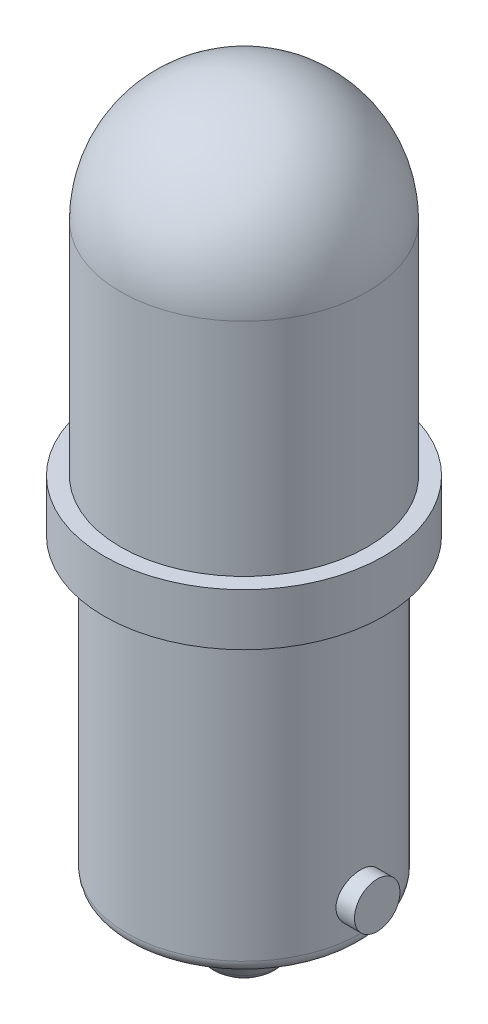
ISO-10303-21;
HEADER;
FILE_DESCRIPTION(('STEP AP214'),'2;1');
FILE_NAME('part.step','',(''),(''),'','','');
FILE_SCHEMA(('AUTOMOTIVE_DESIGN { 1 0 10303 214 1 1 1 1 }'));
ENDSEC;
DATA;
#1=APPLICATION_CONTEXT('core data for automotive mechanical design processes');
#2=APPLICATION_PROTOCOL_DEFINITION('international standard','automotive_design',2000,#1);
#3=PRODUCT_CONTEXT('',#1,'mechanical');
#4=PRODUCT('Part','Part','',(#3));
#5=PRODUCT_RELATED_PRODUCT_CATEGORY('part','',(#4));
#6=PRODUCT_DEFINITION_FORMATION('','',#4);
#7=PRODUCT_DEFINITION_CONTEXT('part definition',#1,'design');
#8=PRODUCT_DEFINITION('design','',#6,#7);
#9=PRODUCT_DEFINITION_SHAPE('','',#8);
#10=(LENGTH_UNIT() NAMED_UNIT(*) SI_UNIT(.MILLI.,.METRE.));
#11=(NAMED_UNIT(*) PLANE_ANGLE_UNIT() SI_UNIT($,.RADIAN.));
#12=(NAMED_UNIT(*) SI_UNIT($,.STERADIAN.) SOLID_ANGLE_UNIT());
#13=UNCERTAINTY_MEASURE_WITH_UNIT(LENGTH_MEASURE(1.E-05),#10,'distance_accuracy_value','');
#14=(GEOMETRIC_REPRESENTATION_CONTEXT(3) GLOBAL_UNCERTAINTY_ASSIGNED_CONTEXT((#13)) GLOBAL_UNIT_ASSIGNED_CONTEXT((#10,
#11,#12)) REPRESENTATION_CONTEXT('',''));
#15=CARTESIAN_POINT('',(0.,0.,0.));
#16=DIRECTION('',(0.,0.,1.));
#17=DIRECTION('',(1.,0.,0.));
#18=AXIS2_PLACEMENT_3D('',#15,#16,#17);
#19=CARTESIAN_POINT('',(0.,-11.684,0.));
#20=DIRECTION('',(0.,1.,0.));
#21=DIRECTION('',(0.,0.,1.));
#22=AXIS2_PLACEMENT_3D('',#19,#20,#21);
#23=CYLINDRICAL_SURFACE('',#22,4.572);
#24=CARTESIAN_POINT('',(-4.48473667008443,-9.906,0.889));
#25=CARTESIAN_POINT('',(-4.484737642636,-9.85657359150601,0.888998140814005));
#26=CARTESIAN_POINT('',(-4.48556264448461,-9.80712345159846,0.884864010478837));
#27=CARTESIAN_POINT('',(-4.48876899778666,-9.70962003210988,0.868449308597514));
#28=CARTESIAN_POINT('',(-4.49115162838292,-9.66156793452277,0.856162041476267));
#29=CARTESIAN_POINT('',(-4.49719342142709,-9.56828540528058,0.823834764819868));
#30=CARTESIAN_POINT('',(-4.50085135033537,-9.52305229659918,0.803802244891879));
#31=CARTESIAN_POINT('',(-4.50903011912911,-9.43659091599146,0.756573321078222));
#32=CARTESIAN_POINT('',(-4.51355090221067,-9.39536238070328,0.729377388733529));
#33=CARTESIAN_POINT('',(-4.52301354107814,-9.31752652000002,0.668205930866874));
#34=CARTESIAN_POINT('',(-4.52795979613049,-9.28098053911341,0.63415301765999));
#35=CARTESIAN_POINT('',(-4.53767728003765,-9.21408225812862,0.560401461641953));
#36=CARTESIAN_POINT('',(-4.54244849696182,-9.18373037958115,0.520702434886226));
#37=CARTESIAN_POINT('',(-4.55132562195848,-9.1298451771,0.436380815476984));
#38=CARTESIAN_POINT('',(-4.55542573977348,-9.10636994302105,0.391720439051687));
#39=CARTESIAN_POINT('',(-4.5624493549543,-9.06727898284693,0.29899640452131));
#40=CARTESIAN_POINT('',(-4.56537295637947,-9.05166256163265,0.250933047842027));
#41=CARTESIAN_POINT('',(-4.56968305148856,-9.02892291194159,0.153403610176242));
#42=CARTESIAN_POINT('',(-4.57108826352083,-9.0216961727316,0.103962504363145));
#43=CARTESIAN_POINT('',(-4.57226783937727,-9.01561827081581,0.00455097775357867));
#44=CARTESIAN_POINT('',(-4.57204235209319,-9.01676634344402,-0.0454193943019874));
#45=CARTESIAN_POINT('',(-4.57000049582018,-9.02732657031017,-0.143760338651606));
#46=CARTESIAN_POINT('',(-4.56820558784158,-9.03662724621937,-0.192143392135824));
#47=CARTESIAN_POINT('',(-4.56325070896854,-9.06305207698569,-0.286648733786454));
#48=CARTESIAN_POINT('',(-4.56009068561256,-9.08017653251293,-0.332770934992221));
#49=CARTESIAN_POINT('',(-4.55272504103654,-9.1218674245143,-0.421765763206312));
#50=CARTESIAN_POINT('',(-4.54851325438613,-9.14647793663826,-0.46461721121851));
#51=CARTESIAN_POINT('',(-4.53950905688584,-9.20240978841156,-0.545623587310608));
#52=CARTESIAN_POINT('',(-4.53471658274704,-9.23373185983752,-0.583778002547482));
#53=CARTESIAN_POINT('',(-4.52498782298533,-9.30281051926224,-0.654968341766946));
#54=CARTESIAN_POINT('',(-4.52005046897733,-9.34066465589187,-0.687909533441519));
#55=CARTESIAN_POINT('',(-4.51066361045973,-9.42140925955546,-0.74699088713683));
#56=CARTESIAN_POINT('',(-4.50621411419761,-9.46429981170717,-0.773130934191068));
#57=CARTESIAN_POINT('',(-4.49830490051665,-9.55403106185394,-0.817898080490989));
#58=CARTESIAN_POINT('',(-4.49484711364946,-9.60087923779006,-0.836510554367289));
#59=CARTESIAN_POINT('',(-4.48934168214752,-9.69712045737962,-0.865572782843082));
#60=CARTESIAN_POINT('',(-4.48729386465183,-9.74651318827466,-0.876023538082765));
#61=CARTESIAN_POINT('',(-4.48487467077598,-9.84558480881087,-0.888325567668125));
#62=CARTESIAN_POINT('',(-4.48447668988019,-9.89524611926337,-0.890313326758572));
#63=CARTESIAN_POINT('',(-4.4853309164198,-9.99419086404617,-0.885999571815607));
#64=CARTESIAN_POINT('',(-4.48658303571788,-10.0434743184176,-0.879698500516071));
#65=CARTESIAN_POINT('',(-4.49057152584208,-10.1398101681926,-0.859103391229102));
#66=CARTESIAN_POINT('',(-4.49329446371905,-10.1868786273042,-0.844881656489838));
#67=CARTESIAN_POINT('',(-4.49990609866369,-10.2779646560244,-0.808925964574196));
#68=CARTESIAN_POINT('',(-4.50379488723393,-10.3219819858291,-0.787191417729216));
#69=CARTESIAN_POINT('',(-4.51236019289327,-10.4063153221001,-0.736515775284432));
#70=CARTESIAN_POINT('',(-4.51704585416258,-10.4465788422343,-0.707488908369603));
#71=CARTESIAN_POINT('',(-4.52665157592584,-10.5217131652479,-0.64316752222962));
#72=CARTESIAN_POINT('',(-4.53157165912782,-10.5565834442986,-0.607872394902273));
#73=CARTESIAN_POINT('',(-4.54117781589628,-10.6204554977142,-0.531405089042378));
#74=CARTESIAN_POINT('',(-4.54585948175815,-10.6493652105655,-0.490155370520767));
#75=CARTESIAN_POINT('',(-4.55438579424391,-10.6998439757488,-0.403305270772477));
#76=CARTESIAN_POINT('',(-4.55823047473837,-10.7214133251456,-0.357705065705855));
#77=CARTESIAN_POINT('',(-4.56463074343345,-10.7564632598052,-0.263695999789592));
#78=CARTESIAN_POINT('',(-4.56719335690078,-10.7699880054964,-0.215304102942085));
#79=CARTESIAN_POINT('',(-4.57077081345575,-10.7887052068961,-0.116880818338055));
#80=CARTESIAN_POINT('',(-4.57178583227639,-10.7938986086519,-0.0668496173875124));
#81=CARTESIAN_POINT('',(-4.57214987781822,-10.795770731601,0.032551147359359));
#82=CARTESIAN_POINT('',(-4.57152604199332,-10.7925881474203,0.081918052568314));
#83=CARTESIAN_POINT('',(-4.56873922886259,-10.7781037589498,0.179399337726012));
#84=CARTESIAN_POINT('',(-4.56657626877663,-10.7668020454977,0.227513731681729));
#85=CARTESIAN_POINT('',(-4.56095465402552,-10.7364604280118,0.321043698461544));
#86=CARTESIAN_POINT('',(-4.55749864749902,-10.7174363325758,0.366464568821173));
#87=CARTESIAN_POINT('',(-4.54966396021267,-10.6722070879365,0.453489843197415));
#88=CARTESIAN_POINT('',(-4.54528521148891,-10.6460014097361,0.49509396577009));
#89=CARTESIAN_POINT('',(-4.53600266776793,-10.5866807066539,0.573992974912792));
#90=CARTESIAN_POINT('',(-4.53109185867807,-10.5534660110073,0.611212106731852));
#91=CARTESIAN_POINT('',(-4.52134149617608,-10.4812758434643,0.679596305625663));
#92=CARTESIAN_POINT('',(-4.51650195985403,-10.4422990138576,0.710759941850027));
#93=CARTESIAN_POINT('',(-4.50738858157874,-10.3592203822593,0.766445400699442));
#94=CARTESIAN_POINT('',(-4.50312093083298,-10.315070898635,0.790897137228966));
#95=CARTESIAN_POINT('',(-4.49570961523559,-10.2232204974382,0.831996825679656));
#96=CARTESIAN_POINT('',(-4.49256491264708,-10.1755229082561,0.848651987007617));
#97=CARTESIAN_POINT('',(-4.48839597216564,-10.0907518761683,0.870385702989092));
#98=CARTESIAN_POINT('',(-4.48703207687263,-10.0541678638263,0.877353814277506));
#99=CARTESIAN_POINT('',(-4.48520207374987,-9.98039370356091,0.886661590623503));
#100=CARTESIAN_POINT('',(-4.48473593803863,-9.94320357449763,0.889001399421215));
#101=CARTESIAN_POINT('',(-4.48473667008443,-9.906,0.889));
#102=B_SPLINE_CURVE_WITH_KNOTS('',3,(#24,#25,#26,#27,#28,#29,#30,#31,#32,#33,#34,#35,#36,#37,
#38,#39,#40,#41,#42,#43,#44,#45,#46,#47,#48,#49,#50,#51,#52,#53,#54,#55,#56,#57,#58,#59,#60,#61,
#62,#63,#64,#65,#66,#67,#68,#69,#70,#71,#72,#73,#74,#75,#76,#77,#78,#79,#80,#81,#82,#83,#84,#85,
#86,#87,#88,#89,#90,#91,#92,#93,#94,#95,#96,#97,#98,#99,#100,#101),.UNSPECIFIED.,.T.,.F.,(4,2,2,
2,2,2,2,2,2,2,2,2,2,2,2,2,2,2,2,2,2,2,2,2,2,2,2,2,2,2,2,2,2,2,2,2,2,2,4),(0.,0.148143039013353,
0.296407887891953,0.444529722802273,0.592641809835036,0.742530003786011,0.892428395246965,
1.04355875704167,1.19467574886872,1.34390777125264,1.4931261681099,1.64033544148188,
1.78755037262498,1.93564941207766,2.08376460733058,2.23432114053152,2.38488021857372,
2.53573042953052,2.68656214309756,2.83495191933392,2.98333376990286,3.1303828167238,
3.27744340781087,3.42632208126376,3.57521520576778,3.72625941625855,3.87729751325542,
4.0274986538357,4.17768273745278,4.32539569030554,4.47310699055748,4.62051742170219,
4.76793871405207,4.91761777898949,5.06733216863368,5.21855506542092,5.36963785049518,
5.48114952880724,5.59265774387224),.UNSPECIFIED.);
#103=CARTESIAN_POINT('',(-4.48473667008443,-9.906,0.889));
#104=VERTEX_POINT('',#103);
#105=EDGE_CURVE('E44',#104,#104,#102,.T.);
#106=ORIENTED_EDGE('',*,*,#105,.F.);
#107=EDGE_LOOP('',(#106));
#108=FACE_BOUND('',#107,.T.);
#109=CARTESIAN_POINT('',(0.,-11.176,0.));
#110=DIRECTION('',(0.,-1.,0.));
#111=DIRECTION('',(0.,0.,-1.));
#112=AXIS2_PLACEMENT_3D('',#109,#110,#111);
#113=CIRCLE('',#112,4.572);
#114=CARTESIAN_POINT('',(0.,-11.176,-4.572));
#115=VERTEX_POINT('',#114);
#116=EDGE_CURVE('E48',#115,#115,#113,.F.);
#117=ORIENTED_EDGE('',*,*,#116,.T.);
#118=EDGE_LOOP('',(#117));
#119=FACE_BOUND('',#118,.T.);
#120=CARTESIAN_POINT('',(0.,0.,0.));
#121=DIRECTION('',(0.,1.,0.));
#122=DIRECTION('',(0.,0.,1.));
#123=AXIS2_PLACEMENT_3D('',#120,#121,#122);
#124=CIRCLE('',#123,4.572);
#125=CARTESIAN_POINT('',(0.,0.,4.572));
#126=VERTEX_POINT('',#125);
#127=EDGE_CURVE('E118',#126,#126,#124,.F.);
#128=ORIENTED_EDGE('',*,*,#127,.T.);
#129=EDGE_LOOP('',(#128));
#130=FACE_BOUND('',#129,.T.);
#131=CARTESIAN_POINT('',(4.48473667008443,-9.906,0.889));
#132=CARTESIAN_POINT('',(4.484737642636,-9.95542640849399,0.888998140814005));
#133=CARTESIAN_POINT('',(4.48556264448461,-10.0048765484015,0.884864010478837));
#134=CARTESIAN_POINT('',(4.48876899778666,-10.1023799678901,0.868449308597514));
#135=CARTESIAN_POINT('',(4.49115162838292,-10.1504320654772,0.856162041476267));
#136=CARTESIAN_POINT('',(4.49719342142709,-10.2437145947194,0.823834764819868));
#137=CARTESIAN_POINT('',(4.50085135033537,-10.2889477034008,0.803802244891879));
#138=CARTESIAN_POINT('',(4.50903011912911,-10.3754090840085,0.756573321078222));
#139=CARTESIAN_POINT('',(4.51355090221067,-10.4166376192967,0.729377388733529));
#140=CARTESIAN_POINT('',(4.52301354107814,-10.49447348,0.668205930866874));
#141=CARTESIAN_POINT('',(4.52795979613049,-10.5310194608866,0.63415301765999));
#142=CARTESIAN_POINT('',(4.53767728003765,-10.5979177418714,0.560401461641953));
#143=CARTESIAN_POINT('',(4.54244849696182,-10.6282696204189,0.520702434886226));
#144=CARTESIAN_POINT('',(4.55132562195848,-10.6821548229,0.436380815476984));
#145=CARTESIAN_POINT('',(4.55542573977348,-10.705630056979,0.391720439051687));
#146=CARTESIAN_POINT('',(4.5624493549543,-10.7447210171531,0.29899640452131));
#147=CARTESIAN_POINT('',(4.56537295637947,-10.7603374383674,0.250933047842027));
#148=CARTESIAN_POINT('',(4.56968305148856,-10.7830770880584,0.153403610176242));
#149=CARTESIAN_POINT('',(4.57108826352083,-10.7903038272684,0.103962504363145));
#150=CARTESIAN_POINT('',(4.57226783937727,-10.7963817291842,0.00455097775357867));
#151=CARTESIAN_POINT('',(4.57204235209319,-10.795233656556,-0.0454193943019874));
#152=CARTESIAN_POINT('',(4.57000049582018,-10.7846734296898,-0.143760338651606));
#153=CARTESIAN_POINT('',(4.56820558784158,-10.7753727537806,-0.192143392135824));
#154=CARTESIAN_POINT('',(4.56325070896854,-10.7489479230143,-0.286648733786454));
#155=CARTESIAN_POINT('',(4.56009068561256,-10.7318234674871,-0.332770934992221));
#156=CARTESIAN_POINT('',(4.55272504103654,-10.6901325754857,-0.421765763206312));
#157=CARTESIAN_POINT('',(4.54851325438613,-10.6655220633617,-0.46461721121851));
#158=CARTESIAN_POINT('',(4.53950905688584,-10.6095902115884,-0.545623587310608));
#159=CARTESIAN_POINT('',(4.53471658274704,-10.5782681401625,-0.583778002547482));
#160=CARTESIAN_POINT('',(4.52498782298533,-10.5091894807378,-0.654968341766946));
#161=CARTESIAN_POINT('',(4.52005046897733,-10.4713353441081,-0.687909533441519));
#162=CARTESIAN_POINT('',(4.51066361045973,-10.3905907404445,-0.74699088713683));
#163=CARTESIAN_POINT('',(4.50621411419761,-10.3477001882928,-0.773130934191068));
#164=CARTESIAN_POINT('',(4.49830490051665,-10.2579689381461,-0.817898080490989));
#165=CARTESIAN_POINT('',(4.49484711364946,-10.2111207622099,-0.836510554367289));
#166=CARTESIAN_POINT('',(4.48934168214752,-10.1148795426204,-0.865572782843082));
#167=CARTESIAN_POINT('',(4.48729386465183,-10.0654868117253,-0.876023538082765));
#168=CARTESIAN_POINT('',(4.48487467077598,-9.96641519118913,-0.888325567668125));
#169=CARTESIAN_POINT('',(4.48447668988019,-9.91675388073663,-0.890313326758572));
#170=CARTESIAN_POINT('',(4.4853309164198,-9.81780913595383,-0.885999571815607));
#171=CARTESIAN_POINT('',(4.48658303571788,-9.76852568158241,-0.879698500516071));
#172=CARTESIAN_POINT('',(4.49057152584208,-9.67218983180742,-0.859103391229102));
#173=CARTESIAN_POINT('',(4.49329446371905,-9.62512137269583,-0.844881656489838));
#174=CARTESIAN_POINT('',(4.49990609866369,-9.53403534397561,-0.808925964574196));
#175=CARTESIAN_POINT('',(4.50379488723393,-9.49001801417092,-0.787191417729216));
#176=CARTESIAN_POINT('',(4.51236019289327,-9.40568467789989,-0.736515775284432));
#177=CARTESIAN_POINT('',(4.51704585416258,-9.3654211577657,-0.707488908369603));
#178=CARTESIAN_POINT('',(4.52665157592584,-9.29028683475211,-0.64316752222962));
#179=CARTESIAN_POINT('',(4.53157165912782,-9.25541655570135,-0.607872394902273));
#180=CARTESIAN_POINT('',(4.54117781589628,-9.19154450228584,-0.531405089042378));
#181=CARTESIAN_POINT('',(4.54585948175815,-9.16263478943446,-0.490155370520766));
#182=CARTESIAN_POINT('',(4.55438579424391,-9.11215602425116,-0.403305270772475));
#183=CARTESIAN_POINT('',(4.55823047473837,-9.09058667485437,-0.357705065705854));
#184=CARTESIAN_POINT('',(4.56463074343345,-9.05553674019479,-0.263695999789592));
#185=CARTESIAN_POINT('',(4.56719335690078,-9.04201199450364,-0.215304102942086));
#186=CARTESIAN_POINT('',(4.57077081345575,-9.02329479310389,-0.116880818338056));
#187=CARTESIAN_POINT('',(4.57178583227639,-9.01810139134811,-0.0668496173875125));
#188=CARTESIAN_POINT('',(4.57214987781822,-9.01622926839897,0.032551147359359));
#189=CARTESIAN_POINT('',(4.57152604199332,-9.01941185257974,0.081918052568314));
#190=CARTESIAN_POINT('',(4.56873922886259,-9.03389624105021,0.179399337726012));
#191=CARTESIAN_POINT('',(4.56657626877663,-9.04519795450233,0.227513731681729));
#192=CARTESIAN_POINT('',(4.56095465402552,-9.07553957198825,0.321043698461544));
#193=CARTESIAN_POINT('',(4.55749864749902,-9.0945636674242,0.366464568821173));
#194=CARTESIAN_POINT('',(4.54966396021267,-9.13979291206355,0.453489843197415));
#195=CARTESIAN_POINT('',(4.54528521148891,-9.16599859026393,0.49509396577009));
#196=CARTESIAN_POINT('',(4.53600266776793,-9.22531929334614,0.573992974912792));
#197=CARTESIAN_POINT('',(4.53109185867807,-9.25853398899273,0.611212106731852));
#198=CARTESIAN_POINT('',(4.52134149617608,-9.33072415653566,0.679596305625663));
#199=CARTESIAN_POINT('',(4.51650195985403,-9.36970098614244,0.710759941850027));
#200=CARTESIAN_POINT('',(4.50738858157874,-9.45277961774074,0.766445400699442));
#201=CARTESIAN_POINT('',(4.50312093083298,-9.496929101365,0.790897137228966));
#202=CARTESIAN_POINT('',(4.49570961523559,-9.5887795025618,0.831996825679656));
#203=CARTESIAN_POINT('',(4.49256491264708,-9.63647709174388,0.848651987007617));
#204=CARTESIAN_POINT('',(4.48839597216564,-9.72124812383174,0.870385702989092));
#205=CARTESIAN_POINT('',(4.48703207687263,-9.75783213617368,0.877353814277506));
#206=CARTESIAN_POINT('',(4.48520207374987,-9.83160629643909,0.886661590623503));
#207=CARTESIAN_POINT('',(4.48473593803863,-9.86879642550237,0.889001399421215));
#208=CARTESIAN_POINT('',(4.48473667008443,-9.906,0.889));
#209=B_SPLINE_CURVE_WITH_KNOTS('',3,(#131,#132,#133,#134,#135,#136,#137,#138,#139,#140,#141,
#142,#143,#144,#145,#146,#147,#148,#149,#150,#151,#152,#153,#154,#155,#156,#157,#158,#159,#160,
#161,#162,#163,#164,#165,#166,#167,#168,#169,#170,#171,#172,#173,#174,#175,#176,#177,#178,#179,
#180,#181,#182,#183,#184,#185,#186,#187,#188,#189,#190,#191,#192,#193,#194,#195,#196,#197,#198,
#199,#200,#201,#202,#203,#204,#205,#206,#207,#208),.UNSPECIFIED.,.T.,.F.,(4,2,2,2,2,2,2,2,2,2,2,
2,2,2,2,2,2,2,2,2,2,2,2,2,2,2,2,2,2,2,2,2,2,2,2,2,2,2,4),(0.,0.148143039013353,
0.296407887891953,0.444529722802275,0.592641809835037,0.742530003786011,0.892428395246965,
1.04355875704167,1.19467574886872,1.34390777125264,1.4931261681099,1.64033544148188,
1.78755037262498,1.93564941207766,2.08376460733058,2.23432114053152,2.38488021857372,
2.53573042953052,2.68656214309756,2.83495191933392,2.98333376990286,3.1303828167238,
3.27744340781087,3.42632208126376,3.57521520576778,3.72625941625855,3.87729751325542,
4.0274986538357,4.17768273745278,4.32539569030554,4.47310699055748,4.62051742170219,
4.76793871405207,4.91761777898949,5.06733216863368,5.21855506542092,5.36963785049518,
5.48114952880724,5.59265774387224),.UNSPECIFIED.);
#210=CARTESIAN_POINT('',(4.48473667008443,-9.906,0.889));
#211=VERTEX_POINT('',#210);
#212=EDGE_CURVE('E10',#211,#211,#209,.T.);
#213=ORIENTED_EDGE('',*,*,#212,.F.);
#214=EDGE_LOOP('',(#213));
#215=FACE_BOUND('',#214,.T.);
#216=ADVANCED_FACE('F33',(#108,#119,#130,#215),#23,.T.);
#217=CARTESIAN_POINT('',(0.,-11.684,0.));
#218=DIRECTION('',(0.,-1.,0.));
#219=DIRECTION('',(0.,0.,-1.));
#220=AXIS2_PLACEMENT_3D('',#217,#218,#219);
#221=PLANE('',#220);
#222=CARTESIAN_POINT('',(0.,-11.684,0.));
#223=DIRECTION('',(0.,-1.,0.));
#224=DIRECTION('',(0.,0.,-1.));
#225=AXIS2_PLACEMENT_3D('',#222,#223,#224);
#226=CIRCLE('',#225,4.064);
#227=CARTESIAN_POINT('',(0.,-11.684,-4.064));
#228=VERTEX_POINT('',#227);
#229=EDGE_CURVE('E52',#228,#228,#226,.T.);
#230=ORIENTED_EDGE('',*,*,#229,.T.);
#231=EDGE_LOOP('',(#230));
#232=FACE_BOUND('',#231,.T.);
#233=CARTESIAN_POINT('',(0.,-11.684,0.));
#234=DIRECTION('',(0.,-1.,0.));
#235=DIRECTION('',(0.,0.,-1.));
#236=AXIS2_PLACEMENT_3D('',#233,#234,#235);
#237=CIRCLE('',#236,2.921);
#238=CARTESIAN_POINT('',(0.,-11.684,-2.921));
#239=VERTEX_POINT('',#238);
#240=EDGE_CURVE('E97',#239,#239,#237,.T.);
#241=ORIENTED_EDGE('',*,*,#240,.F.);
#242=EDGE_LOOP('',(#241));
#243=FACE_BOUND('',#242,.T.);
#244=ADVANCED_FACE('F80',(#232,#243),#221,.T.);
#245=CARTESIAN_POINT('',(0.,0.,0.));
#246=DIRECTION('',(0.,1.,0.));
#247=DIRECTION('',(0.,0.,1.));
#248=AXIS2_PLACEMENT_3D('',#245,#246,#247);
#249=PLANE('',#248);
#250=CARTESIAN_POINT('',(0.,0.,0.));
#251=DIRECTION('',(0.,-1.,0.));
#252=DIRECTION('',(0.,0.,-1.));
#253=AXIS2_PLACEMENT_3D('',#250,#251,#252);
#254=CIRCLE('',#253,5.461);
#255=CARTESIAN_POINT('',(0.,0.,-5.461));
#256=VERTEX_POINT('',#255);
#257=EDGE_CURVE('E99',#256,#256,#254,.T.);
#258=ORIENTED_EDGE('',*,*,#257,.T.);
#259=EDGE_LOOP('',(#258));
#260=FACE_BOUND('',#259,.T.);
#261=ORIENTED_EDGE('',*,*,#127,.F.);
#262=EDGE_LOOP('',(#261));
#263=FACE_BOUND('',#262,.T.);
#264=ADVANCED_FACE('F82',(#260,#263),#249,.F.);
#265=CARTESIAN_POINT('',(0.,15.494,0.));
#266=DIRECTION('',(0.,-1.,0.));
#267=DIRECTION('',(0.,0.,-1.));
#268=AXIS2_PLACEMENT_3D('',#265,#266,#267);
#269=CYLINDRICAL_SURFACE('',#268,4.826);
#270=CARTESIAN_POINT('',(0.,10.668,0.));
#271=DIRECTION('',(0.,-1.,0.));
#272=DIRECTION('',(0.,0.,-1.));
#273=AXIS2_PLACEMENT_3D('',#270,#271,#272);
#274=CIRCLE('',#273,4.826);
#275=CARTESIAN_POINT('',(0.,10.668,-4.826));
#276=VERTEX_POINT('',#275);
#277=EDGE_CURVE('E111',#276,#276,#274,.T.);
#278=ORIENTED_EDGE('',*,*,#277,.T.);
#279=EDGE_LOOP('',(#278));
#280=FACE_BOUND('',#279,.T.);
#281=CARTESIAN_POINT('',(0.,2.032,0.));
#282=DIRECTION('',(0.,-1.,0.));
#283=DIRECTION('',(0.,0.,-1.));
#284=AXIS2_PLACEMENT_3D('',#281,#282,#283);
#285=CIRCLE('',#284,4.826);
#286=CARTESIAN_POINT('',(0.,2.032,-4.826));
#287=VERTEX_POINT('',#286);
#288=EDGE_CURVE('E115',#287,#287,#285,.T.);
#289=ORIENTED_EDGE('',*,*,#288,.F.);
#290=EDGE_LOOP('',(#289));
#291=FACE_BOUND('',#290,.T.);
#292=ADVANCED_FACE('F88',(#280,#291),#269,.T.);
#293=CARTESIAN_POINT('',(0.,10.668,0.));
#294=DIRECTION('',(0.,0.,1.));
#295=DIRECTION('',(1.,0.,0.));
#296=AXIS2_PLACEMENT_3D('',#293,#294,#295);
#297=SPHERICAL_SURFACE('',#296,4.826);
#298=CARTESIAN_POINT('',(0.,10.668,0.));
#299=DIRECTION('',(0.,-1.,0.));
#300=DIRECTION('',(0.,0.,-1.));
#301=AXIS2_PLACEMENT_3D('',#298,#299,#300);
#302=SPHERICAL_SURFACE('',#301,4.826);
#303=ORIENTED_EDGE('',*,*,#277,.F.);
#304=EDGE_LOOP('',(#303));
#305=FACE_BOUND('',#304,.T.);
#306=ADVANCED_FACE('F136',(#305),#302,.T.);
#307=CARTESIAN_POINT('',(0.,2.032,0.));
#308=DIRECTION('',(0.,-1.,0.));
#309=DIRECTION('',(0.,0.,-1.));
#310=AXIS2_PLACEMENT_3D('',#307,#308,#309);
#311=PLANE('',#310);
#312=CARTESIAN_POINT('',(0.,2.032,0.));
#313=DIRECTION('',(0.,-1.,0.));
#314=DIRECTION('',(0.,0.,-1.));
#315=AXIS2_PLACEMENT_3D('',#312,#313,#314);
#316=CIRCLE('',#315,5.461);
#317=CARTESIAN_POINT('',(0.,2.032,-5.461));
#318=VERTEX_POINT('',#317);
#319=EDGE_CURVE('E103',#318,#318,#316,.T.);
#320=ORIENTED_EDGE('',*,*,#319,.F.);
#321=EDGE_LOOP('',(#320));
#322=FACE_BOUND('',#321,.T.);
#323=ORIENTED_EDGE('',*,*,#288,.T.);
#324=EDGE_LOOP('',(#323));
#325=FACE_BOUND('',#324,.T.);
#326=ADVANCED_FACE('F139',(#322,#325),#311,.F.);
#327=CARTESIAN_POINT('',(0.,2.032,0.));
#328=DIRECTION('',(0.,-1.,0.));
#329=DIRECTION('',(0.,0.,-1.));
#330=AXIS2_PLACEMENT_3D('',#327,#328,#329);
#331=CYLINDRICAL_SURFACE('',#330,5.461);
#332=ORIENTED_EDGE('',*,*,#319,.T.);
#333=EDGE_LOOP('',(#332));
#334=FACE_BOUND('',#333,.T.);
#335=ORIENTED_EDGE('',*,*,#257,.F.);
#336=EDGE_LOOP('',(#335));
#337=FACE_BOUND('',#336,.T.);
#338=ADVANCED_FACE('F78',(#334,#337),#331,.T.);
#339=CARTESIAN_POINT('',(0.,-11.684,0.));
#340=DIRECTION('',(0.,1.,0.));
#341=DIRECTION('',(0.,0.,-1.));
#342=AXIS2_PLACEMENT_3D('',#339,#340,#341);
#343=CONICAL_SURFACE('',#342,2.921,0.610865238198017);
#344=CARTESIAN_POINT('',(0.,-13.9364420741658,0.));
#345=DIRECTION('',(0.,1.,0.));
#346=DIRECTION('',(0.,0.,1.));
#347=AXIS2_PLACEMENT_3D('',#344,#345,#346);
#348=CIRCLE('',#347,1.34382308028837);
#349=CARTESIAN_POINT('',(0.,-13.9364420741658,1.34382308028837));
#350=VERTEX_POINT('',#349);
#351=EDGE_CURVE('E124',#350,#350,#348,.T.);
#352=ORIENTED_EDGE('',*,*,#351,.T.);
#353=EDGE_LOOP('',(#352));
#354=FACE_BOUND('',#353,.T.);
#355=ORIENTED_EDGE('',*,*,#240,.T.);
#356=EDGE_LOOP('',(#355));
#357=FACE_BOUND('',#356,.T.);
#358=ADVANCED_FACE('F75',(#354,#357),#343,.T.);
#359=CARTESIAN_POINT('',(0.,-14.478,0.));
#360=DIRECTION('',(0.,-1.,0.));
#361=DIRECTION('',(0.,0.,-1.));
#362=AXIS2_PLACEMENT_3D('',#359,#360,#361);
#363=PLANE('',#362);
#364=CARTESIAN_POINT('',(0.,-14.478,0.));
#365=DIRECTION('',(0.,-1.,0.));
#366=DIRECTION('',(0.,0.,-1.));
#367=AXIS2_PLACEMENT_3D('',#364,#365,#366);
#368=CIRCLE('',#367,0.303499984041348);
#369=CARTESIAN_POINT('',(0.,-14.478,-0.303499984041348));
#370=VERTEX_POINT('',#369);
#371=EDGE_CURVE('E121',#370,#370,#368,.T.);
#372=ORIENTED_EDGE('',*,*,#371,.T.);
#373=EDGE_LOOP('',(#372));
#374=FACE_BOUND('',#373,.T.);
#375=ADVANCED_FACE('F70',(#374),#363,.T.);
#376=CARTESIAN_POINT('',(0.,-13.208,0.));
#377=DIRECTION('',(0.,-1.,0.));
#378=DIRECTION('',(0.,0.,-1.));
#379=AXIS2_PLACEMENT_3D('',#376,#377,#378);
#380=DEGENERATE_TOROIDAL_SURFACE('',#379,0.303499984041348,1.27,.T.);
#381=ORIENTED_EDGE('',*,*,#351,.F.);
#382=EDGE_LOOP('',(#381));
#383=FACE_BOUND('',#382,.T.);
#384=ORIENTED_EDGE('',*,*,#371,.F.);
#385=EDGE_LOOP('',(#384));
#386=FACE_BOUND('',#385,.T.);
#387=ADVANCED_FACE('F74',(#383,#386),#380,.T.);
#388=CARTESIAN_POINT('',(0.,-11.176,0.));
#389=DIRECTION('',(0.,-1.,0.));
#390=DIRECTION('',(0.,0.,-1.));
#391=AXIS2_PLACEMENT_3D('',#388,#389,#390);
#392=TOROIDAL_SURFACE('',#391,4.064,0.508);
#393=ORIENTED_EDGE('',*,*,#116,.F.);
#394=EDGE_LOOP('',(#393));
#395=FACE_BOUND('',#394,.T.);
#396=ORIENTED_EDGE('',*,*,#229,.F.);
#397=EDGE_LOOP('',(#396));
#398=FACE_BOUND('',#397,.T.);
#399=ADVANCED_FACE('F35',(#395,#398),#392,.T.);
#400=CARTESIAN_POINT('',(-5.207,-9.906,0.));
#401=DIRECTION('',(1.,0.,0.));
#402=DIRECTION('',(0.,0.,-1.));
#403=AXIS2_PLACEMENT_3D('',#400,#401,#402);
#404=PLANE('',#403);
#405=CARTESIAN_POINT('',(-5.207,-9.906,0.));
#406=DIRECTION('',(1.,0.,0.));
#407=DIRECTION('',(0.,0.,-1.));
#408=AXIS2_PLACEMENT_3D('',#405,#406,#407);
#409=CIRCLE('',#408,0.889);
#410=CARTESIAN_POINT('',(-5.207,-9.906,-0.889));
#411=VERTEX_POINT('',#410);
#412=EDGE_CURVE('E106',#411,#411,#409,.T.);
#413=ORIENTED_EDGE('',*,*,#412,.F.);
#414=EDGE_LOOP('',(#413));
#415=FACE_BOUND('',#414,.T.);
#416=ADVANCED_FACE('F68',(#415),#404,.F.);
#417=CARTESIAN_POINT('',(5.207,-9.906,0.));
#418=DIRECTION('',(-1.,0.,0.));
#419=DIRECTION('',(0.,0.,1.));
#420=AXIS2_PLACEMENT_3D('',#417,#418,#419);
#421=CYLINDRICAL_SURFACE('',#420,0.889);
#422=ORIENTED_EDGE('',*,*,#412,.T.);
#423=EDGE_LOOP('',(#422));
#424=FACE_BOUND('',#423,.T.);
#425=ORIENTED_EDGE('',*,*,#105,.T.);
#426=EDGE_LOOP('',(#425));
#427=FACE_BOUND('',#426,.T.);
#428=ADVANCED_FACE('F66',(#424,#427),#421,.T.);
#429=CARTESIAN_POINT('',(5.207,-9.906,0.));
#430=DIRECTION('',(1.,0.,0.));
#431=DIRECTION('',(0.,0.,-1.));
#432=AXIS2_PLACEMENT_3D('',#429,#430,#431);
#433=CIRCLE('',#432,0.889);
#434=CARTESIAN_POINT('',(5.207,-9.906,-0.889));
#435=VERTEX_POINT('',#434);
#436=EDGE_CURVE('E100',#435,#435,#433,.T.);
#437=ORIENTED_EDGE('',*,*,#436,.F.);
#438=EDGE_LOOP('',(#437));
#439=FACE_BOUND('',#438,.T.);
#440=ORIENTED_EDGE('',*,*,#212,.T.);
#441=EDGE_LOOP('',(#440));
#442=FACE_BOUND('',#441,.T.);
#443=ADVANCED_FACE('F60',(#439,#442),#421,.T.);
#444=CARTESIAN_POINT('',(5.207,-9.906,0.));
#445=DIRECTION('',(1.,0.,0.));
#446=DIRECTION('',(0.,0.,-1.));
#447=AXIS2_PLACEMENT_3D('',#444,#445,#446);
#448=PLANE('',#447);
#449=ORIENTED_EDGE('',*,*,#436,.T.);
#450=EDGE_LOOP('',(#449));
#451=FACE_BOUND('',#450,.T.);
#452=ADVANCED_FACE('F65',(#451),#448,.T.);
#453=CLOSED_SHELL('',(#216,#244,#264,#292,#306,#326,#338,#358,#375,#387,#399,#416,#428,#443,#452));
#454=MANIFOLD_SOLID_BREP('B2',#453);
#455=ADVANCED_BREP_SHAPE_REPRESENTATION('',(#18,#454),#14);
#456=SHAPE_DEFINITION_REPRESENTATION(#9,#455);
ENDSEC;
END-ISO-10303-21;
